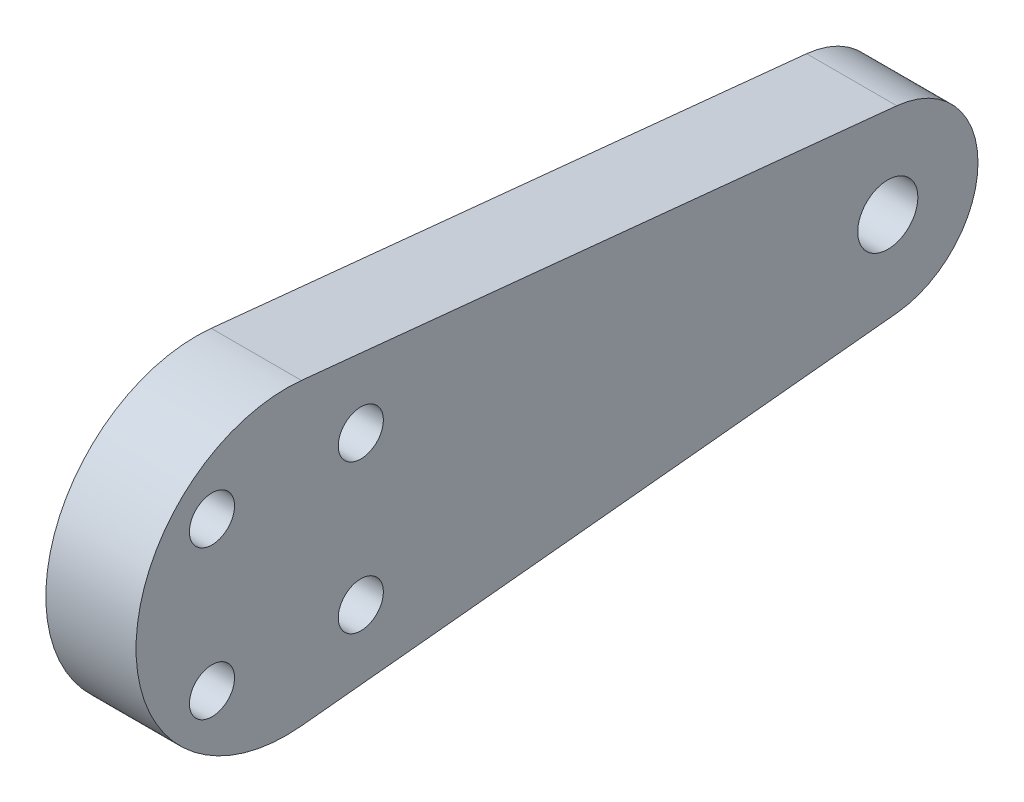
ISO-10303-21;
HEADER;
FILE_DESCRIPTION(('STEP AP214'),'2;1');
FILE_NAME('part.step','',(''),(''),'','','');
FILE_SCHEMA(('AUTOMOTIVE_DESIGN { 1 0 10303 214 1 1 1 1 }'));
ENDSEC;
DATA;
#1=APPLICATION_CONTEXT('core data for automotive mechanical design processes');
#2=APPLICATION_PROTOCOL_DEFINITION('international standard','automotive_design',2000,#1);
#3=PRODUCT_CONTEXT('',#1,'mechanical');
#4=PRODUCT('Part','Part','',(#3));
#5=PRODUCT_RELATED_PRODUCT_CATEGORY('part','',(#4));
#6=PRODUCT_DEFINITION_FORMATION('','',#4);
#7=PRODUCT_DEFINITION_CONTEXT('part definition',#1,'design');
#8=PRODUCT_DEFINITION('design','',#6,#7);
#9=PRODUCT_DEFINITION_SHAPE('','',#8);
#10=(LENGTH_UNIT() NAMED_UNIT(*) SI_UNIT(.MILLI.,.METRE.));
#11=(NAMED_UNIT(*) PLANE_ANGLE_UNIT() SI_UNIT($,.RADIAN.));
#12=(NAMED_UNIT(*) SI_UNIT($,.STERADIAN.) SOLID_ANGLE_UNIT());
#13=UNCERTAINTY_MEASURE_WITH_UNIT(LENGTH_MEASURE(1.E-05),#10,'distance_accuracy_value','');
#14=(GEOMETRIC_REPRESENTATION_CONTEXT(3) GLOBAL_UNCERTAINTY_ASSIGNED_CONTEXT((#13)) GLOBAL_UNIT_ASSIGNED_CONTEXT((#10,
#11,#12)) REPRESENTATION_CONTEXT('',''));
#15=CARTESIAN_POINT('',(0.,0.,0.));
#16=DIRECTION('',(0.,0.,1.));
#17=DIRECTION('',(1.,0.,0.));
#18=AXIS2_PLACEMENT_3D('',#15,#16,#17);
#19=CARTESIAN_POINT('',(3.,0.,0.));
#20=DIRECTION('',(-1.,0.,0.));
#21=DIRECTION('',(0.,0.,1.));
#22=AXIS2_PLACEMENT_3D('',#19,#20,#21);
#23=CYLINDRICAL_SURFACE('',#22,10.0000000000071);
#24=CARTESIAN_POINT('',(-3.,0.,0.));
#25=DIRECTION('',(1.,0.,0.));
#26=DIRECTION('',(0.,0.,-1.));
#27=AXIS2_PLACEMENT_3D('',#24,#25,#26);
#28=CIRCLE('',#27,10.0000000000071);
#29=CARTESIAN_POINT('',(-3.,9.94987437106971,-1.00000000000055));
#30=VERTEX_POINT('',#29);
#31=CARTESIAN_POINT('',(-3.,-9.94987437106975,-1.00000000000014));
#32=VERTEX_POINT('',#31);
#33=EDGE_CURVE('E107',#30,#32,#28,.T.);
#34=ORIENTED_EDGE('',*,*,#33,.T.);
#35=DIRECTION('',(-1.,0.,0.));
#36=VECTOR('',#35,1.);
#37=CARTESIAN_POINT('',(3.,-9.94987437106975,-1.00000000000014));
#38=LINE('',#37,#36);
#39=CARTESIAN_POINT('',(3.,-9.94987437106975,-1.00000000000014));
#40=VERTEX_POINT('',#39);
#41=EDGE_CURVE('E11',#40,#32,#38,.T.);
#42=ORIENTED_EDGE('',*,*,#41,.F.);
#43=CARTESIAN_POINT('',(3.,0.,0.));
#44=DIRECTION('',(1.,0.,0.));
#45=DIRECTION('',(0.,0.,-1.));
#46=AXIS2_PLACEMENT_3D('',#43,#44,#45);
#47=CIRCLE('',#46,10.0000000000071);
#48=CARTESIAN_POINT('',(3.,9.94987437106971,-1.00000000000055));
#49=VERTEX_POINT('',#48);
#50=EDGE_CURVE('E85',#49,#40,#47,.T.);
#51=ORIENTED_EDGE('',*,*,#50,.F.);
#52=DIRECTION('',(-1.,0.,0.));
#53=VECTOR('',#52,1.);
#54=CARTESIAN_POINT('',(3.,9.94987437106971,-1.00000000000055));
#55=LINE('',#54,#53);
#56=EDGE_CURVE('E106',#49,#30,#55,.T.);
#57=ORIENTED_EDGE('',*,*,#56,.T.);
#58=EDGE_LOOP('',(#34,#42,#51,#57));
#59=FACE_BOUND('',#58,.T.);
#60=ADVANCED_FACE('F43',(#59),#23,.T.);
#61=CARTESIAN_POINT('',(3.,-9.94987437106623,-0.999999999999792));
#62=DIRECTION('',(0.,-0.994987437106622,-0.0999999999999791));
#63=DIRECTION('',(0.,0.0999999999999791,-0.994987437106622));
#64=AXIS2_PLACEMENT_3D('',#61,#62,#63);
#65=PLANE('',#64);
#66=DIRECTION('',(0.,-0.0999999999999791,0.994987437106622));
#67=VECTOR('',#66,1.);
#68=CARTESIAN_POINT('',(-3.,-9.94987437106623,-0.999999999999792));
#69=LINE('',#68,#67);
#70=CARTESIAN_POINT('',(-3.,-5.96992462264674,-40.6000000000006));
#71=VERTEX_POINT('',#70);
#72=EDGE_CURVE('E95',#71,#32,#69,.T.);
#73=ORIENTED_EDGE('',*,*,#72,.F.);
#74=DIRECTION('',(-1.,0.,0.));
#75=VECTOR('',#74,1.);
#76=CARTESIAN_POINT('',(3.,-5.96992462264674,-40.6000000000006));
#77=LINE('',#76,#75);
#78=CARTESIAN_POINT('',(3.,-5.96992462264674,-40.6000000000006));
#79=VERTEX_POINT('',#78);
#80=EDGE_CURVE('E51',#79,#71,#77,.T.);
#81=ORIENTED_EDGE('',*,*,#80,.F.);
#82=DIRECTION('',(0.,-0.0999999999999791,0.994987437106622));
#83=VECTOR('',#82,1.);
#84=CARTESIAN_POINT('',(3.,-9.94987437106623,-0.999999999999792));
#85=LINE('',#84,#83);
#86=EDGE_CURVE('E93',#79,#40,#85,.T.);
#87=ORIENTED_EDGE('',*,*,#86,.T.);
#88=ORIENTED_EDGE('',*,*,#41,.T.);
#89=EDGE_LOOP('',(#73,#81,#87,#88));
#90=FACE_BOUND('',#89,.T.);
#91=ADVANCED_FACE('F92',(#90),#65,.T.);
#92=CARTESIAN_POINT('',(3.,-8.30932591879765E-13,-40.0000000000001));
#93=DIRECTION('',(-1.,0.,0.));
#94=DIRECTION('',(0.,0.,1.));
#95=AXIS2_PLACEMENT_3D('',#92,#93,#94);
#96=CYLINDRICAL_SURFACE('',#95,6.00000000001241);
#97=CARTESIAN_POINT('',(-3.,-8.30932591879765E-13,-40.0000000000001));
#98=DIRECTION('',(1.,0.,0.));
#99=DIRECTION('',(0.,0.,-1.));
#100=AXIS2_PLACEMENT_3D('',#97,#98,#99);
#101=CIRCLE('',#100,6.00000000001241);
#102=CARTESIAN_POINT('',(-3.,5.96992462264505,-40.6000000000009));
#103=VERTEX_POINT('',#102);
#104=EDGE_CURVE('E74',#71,#103,#101,.T.);
#105=ORIENTED_EDGE('',*,*,#104,.T.);
#106=DIRECTION('',(-1.,0.,0.));
#107=VECTOR('',#106,1.);
#108=CARTESIAN_POINT('',(3.,5.96992462264505,-40.6000000000009));
#109=LINE('',#108,#107);
#110=CARTESIAN_POINT('',(3.,5.96992462264505,-40.6000000000009));
#111=VERTEX_POINT('',#110);
#112=EDGE_CURVE('E96',#111,#103,#109,.T.);
#113=ORIENTED_EDGE('',*,*,#112,.F.);
#114=CARTESIAN_POINT('',(3.,-8.30932591879765E-13,-40.0000000000001));
#115=DIRECTION('',(1.,0.,0.));
#116=DIRECTION('',(0.,0.,-1.));
#117=AXIS2_PLACEMENT_3D('',#114,#115,#116);
#118=CIRCLE('',#117,6.00000000001241);
#119=EDGE_CURVE('E97',#79,#111,#118,.T.);
#120=ORIENTED_EDGE('',*,*,#119,.F.);
#121=ORIENTED_EDGE('',*,*,#80,.T.);
#122=EDGE_LOOP('',(#105,#113,#120,#121));
#123=FACE_BOUND('',#122,.T.);
#124=ADVANCED_FACE('F98',(#123),#96,.T.);
#125=CARTESIAN_POINT('',(3.,9.94987437106618,-1.0000000000002));
#126=DIRECTION('',(0.,-0.994987437106618,0.10000000000002));
#127=DIRECTION('',(0.,-0.10000000000002,-0.994987437106618));
#128=AXIS2_PLACEMENT_3D('',#125,#126,#127);
#129=PLANE('',#128);
#130=DIRECTION('',(0.,0.10000000000002,0.994987437106618));
#131=VECTOR('',#130,1.);
#132=CARTESIAN_POINT('',(-3.,9.94987437106618,-1.0000000000002));
#133=LINE('',#132,#131);
#134=EDGE_CURVE('E80',#103,#30,#133,.T.);
#135=ORIENTED_EDGE('',*,*,#134,.T.);
#136=ORIENTED_EDGE('',*,*,#56,.F.);
#137=DIRECTION('',(0.,0.10000000000002,0.994987437106618));
#138=VECTOR('',#137,1.);
#139=CARTESIAN_POINT('',(3.,9.94987437106618,-1.0000000000002));
#140=LINE('',#139,#138);
#141=EDGE_CURVE('E59',#111,#49,#140,.T.);
#142=ORIENTED_EDGE('',*,*,#141,.F.);
#143=ORIENTED_EDGE('',*,*,#112,.T.);
#144=EDGE_LOOP('',(#135,#136,#142,#143));
#145=FACE_BOUND('',#144,.T.);
#146=ADVANCED_FACE('F115',(#145),#129,.F.);
#147=CARTESIAN_POINT('',(3.,0.,0.));
#148=DIRECTION('',(1.,0.,0.));
#149=DIRECTION('',(0.,0.,-1.));
#150=AXIS2_PLACEMENT_3D('',#147,#148,#149);
#151=PLANE('',#150);
#152=CARTESIAN_POINT('',(3.,-8.30932544992891E-13,-40.0000000000001));
#153=DIRECTION('',(1.,0.,0.));
#154=DIRECTION('',(0.,0.,-1.));
#155=AXIS2_PLACEMENT_3D('',#152,#153,#154);
#156=CIRCLE('',#155,2.);
#157=CARTESIAN_POINT('',(3.,-8.30932544992891E-13,-42.0000000000001));
#158=VERTEX_POINT('',#157);
#159=EDGE_CURVE('E164',#158,#158,#156,.T.);
#160=ORIENTED_EDGE('',*,*,#159,.F.);
#161=EDGE_LOOP('',(#160));
#162=FACE_BOUND('',#161,.T.);
#163=CARTESIAN_POINT('',(3.,4.94974746830611,4.94974746830556));
#164=DIRECTION('',(1.,0.,0.));
#165=DIRECTION('',(0.,0.,-1.));
#166=AXIS2_PLACEMENT_3D('',#163,#164,#165);
#167=CIRCLE('',#166,1.50000000000047);
#168=CARTESIAN_POINT('',(3.,4.94974746830611,3.44974746830509));
#169=VERTEX_POINT('',#168);
#170=EDGE_CURVE('E180',#169,#169,#167,.T.);
#171=ORIENTED_EDGE('',*,*,#170,.F.);
#172=EDGE_LOOP('',(#171));
#173=FACE_BOUND('',#172,.T.);
#174=CARTESIAN_POINT('',(3.,-4.94974746830555,4.94974746830584));
#175=DIRECTION('',(1.,0.,0.));
#176=DIRECTION('',(0.,0.,-1.));
#177=AXIS2_PLACEMENT_3D('',#174,#175,#176);
#178=CIRCLE('',#177,1.50000000000037);
#179=CARTESIAN_POINT('',(3.,-4.94974746830555,3.44974746830546));
#180=VERTEX_POINT('',#179);
#181=EDGE_CURVE('E173',#180,#180,#178,.T.);
#182=ORIENTED_EDGE('',*,*,#181,.F.);
#183=EDGE_LOOP('',(#182));
#184=FACE_BOUND('',#183,.T.);
#185=CARTESIAN_POINT('',(3.,-4.94974746830584,-4.94974746830583));
#186=DIRECTION('',(1.,0.,0.));
#187=DIRECTION('',(0.,0.,-1.));
#188=AXIS2_PLACEMENT_3D('',#185,#186,#187);
#189=CIRCLE('',#188,1.50000000000006);
#190=CARTESIAN_POINT('',(3.,-4.94974746830584,-6.44974746830589));
#191=VERTEX_POINT('',#190);
#192=EDGE_CURVE('E172',#191,#191,#189,.T.);
#193=ORIENTED_EDGE('',*,*,#192,.F.);
#194=EDGE_LOOP('',(#193));
#195=FACE_BOUND('',#194,.T.);
#196=CARTESIAN_POINT('',(3.,4.94974746830583,-4.94974746830611));
#197=DIRECTION('',(1.,0.,0.));
#198=DIRECTION('',(0.,0.,-1.));
#199=AXIS2_PLACEMENT_3D('',#196,#197,#198);
#200=CIRCLE('',#199,1.50000000000023);
#201=CARTESIAN_POINT('',(3.,4.94974746830583,-6.44974746830634));
#202=VERTEX_POINT('',#201);
#203=EDGE_CURVE('E176',#202,#202,#200,.T.);
#204=ORIENTED_EDGE('',*,*,#203,.F.);
#205=EDGE_LOOP('',(#204));
#206=FACE_BOUND('',#205,.T.);
#207=ORIENTED_EDGE('',*,*,#50,.T.);
#208=ORIENTED_EDGE('',*,*,#86,.F.);
#209=ORIENTED_EDGE('',*,*,#119,.T.);
#210=ORIENTED_EDGE('',*,*,#141,.T.);
#211=EDGE_LOOP('',(#207,#208,#209,#210));
#212=FACE_BOUND('',#211,.T.);
#213=ADVANCED_FACE('F100',(#162,#173,#184,#195,#206,#212),#151,.T.);
#214=CARTESIAN_POINT('',(-3.,0.,0.));
#215=DIRECTION('',(1.,0.,0.));
#216=DIRECTION('',(0.,0.,-1.));
#217=AXIS2_PLACEMENT_3D('',#214,#215,#216);
#218=PLANE('',#217);
#219=CARTESIAN_POINT('',(-3.,-8.30932544992891E-13,-40.0000000000001));
#220=DIRECTION('',(1.,0.,0.));
#221=DIRECTION('',(0.,0.,-1.));
#222=AXIS2_PLACEMENT_3D('',#219,#220,#221);
#223=CIRCLE('',#222,2.);
#224=CARTESIAN_POINT('',(-3.,-8.30932544992891E-13,-42.0000000000001));
#225=VERTEX_POINT('',#224);
#226=EDGE_CURVE('E161',#225,#225,#223,.T.);
#227=ORIENTED_EDGE('',*,*,#226,.T.);
#228=EDGE_LOOP('',(#227));
#229=FACE_BOUND('',#228,.T.);
#230=CARTESIAN_POINT('',(-3.,4.94974746830611,4.94974746830556));
#231=DIRECTION('',(1.,0.,0.));
#232=DIRECTION('',(0.,0.,-1.));
#233=AXIS2_PLACEMENT_3D('',#230,#231,#232);
#234=CIRCLE('',#233,1.50000000000047);
#235=CARTESIAN_POINT('',(-3.,4.94974746830611,3.44974746830509));
#236=VERTEX_POINT('',#235);
#237=EDGE_CURVE('E166',#236,#236,#234,.T.);
#238=ORIENTED_EDGE('',*,*,#237,.T.);
#239=EDGE_LOOP('',(#238));
#240=FACE_BOUND('',#239,.T.);
#241=CARTESIAN_POINT('',(-3.,-4.94974746830555,4.94974746830584));
#242=DIRECTION('',(1.,0.,0.));
#243=DIRECTION('',(0.,0.,-1.));
#244=AXIS2_PLACEMENT_3D('',#241,#242,#243);
#245=CIRCLE('',#244,1.50000000000037);
#246=CARTESIAN_POINT('',(-3.,-4.94974746830555,3.44974746830546));
#247=VERTEX_POINT('',#246);
#248=EDGE_CURVE('E177',#247,#247,#245,.T.);
#249=ORIENTED_EDGE('',*,*,#248,.T.);
#250=EDGE_LOOP('',(#249));
#251=FACE_BOUND('',#250,.T.);
#252=CARTESIAN_POINT('',(-3.,-4.94974746830584,-4.94974746830583));
#253=DIRECTION('',(1.,0.,0.));
#254=DIRECTION('',(0.,0.,-1.));
#255=AXIS2_PLACEMENT_3D('',#252,#253,#254);
#256=CIRCLE('',#255,1.50000000000006);
#257=CARTESIAN_POINT('',(-3.,-4.94974746830584,-6.44974746830589));
#258=VERTEX_POINT('',#257);
#259=EDGE_CURVE('E169',#258,#258,#256,.T.);
#260=ORIENTED_EDGE('',*,*,#259,.T.);
#261=EDGE_LOOP('',(#260));
#262=FACE_BOUND('',#261,.T.);
#263=CARTESIAN_POINT('',(-3.,4.94974746830583,-4.94974746830611));
#264=DIRECTION('',(1.,0.,0.));
#265=DIRECTION('',(0.,0.,-1.));
#266=AXIS2_PLACEMENT_3D('',#263,#264,#265);
#267=CIRCLE('',#266,1.50000000000023);
#268=CARTESIAN_POINT('',(-3.,4.94974746830583,-6.44974746830634));
#269=VERTEX_POINT('',#268);
#270=EDGE_CURVE('E110',#269,#269,#267,.T.);
#271=ORIENTED_EDGE('',*,*,#270,.T.);
#272=EDGE_LOOP('',(#271));
#273=FACE_BOUND('',#272,.T.);
#274=ORIENTED_EDGE('',*,*,#33,.F.);
#275=ORIENTED_EDGE('',*,*,#134,.F.);
#276=ORIENTED_EDGE('',*,*,#104,.F.);
#277=ORIENTED_EDGE('',*,*,#72,.T.);
#278=EDGE_LOOP('',(#274,#275,#276,#277));
#279=FACE_BOUND('',#278,.T.);
#280=ADVANCED_FACE('F118',(#229,#240,#251,#262,#273,#279),#218,.F.);
#281=CARTESIAN_POINT('',(-3.,4.94974746830583,-4.94974746830611));
#282=DIRECTION('',(1.,0.,0.));
#283=DIRECTION('',(0.,0.,-1.));
#284=AXIS2_PLACEMENT_3D('',#281,#282,#283);
#285=CYLINDRICAL_SURFACE('',#284,1.50000000000023);
#286=ORIENTED_EDGE('',*,*,#270,.F.);
#287=EDGE_LOOP('',(#286));
#288=FACE_BOUND('',#287,.T.);
#289=ORIENTED_EDGE('',*,*,#203,.T.);
#290=EDGE_LOOP('',(#289));
#291=FACE_BOUND('',#290,.T.);
#292=ADVANCED_FACE('F133',(#288,#291),#285,.F.);
#293=CARTESIAN_POINT('',(-3.,-4.94974746830584,-4.94974746830583));
#294=DIRECTION('',(1.,0.,0.));
#295=DIRECTION('',(0.,0.,-1.));
#296=AXIS2_PLACEMENT_3D('',#293,#294,#295);
#297=CYLINDRICAL_SURFACE('',#296,1.50000000000006);
#298=ORIENTED_EDGE('',*,*,#259,.F.);
#299=EDGE_LOOP('',(#298));
#300=FACE_BOUND('',#299,.T.);
#301=ORIENTED_EDGE('',*,*,#192,.T.);
#302=EDGE_LOOP('',(#301));
#303=FACE_BOUND('',#302,.T.);
#304=ADVANCED_FACE('F140',(#300,#303),#297,.F.);
#305=CARTESIAN_POINT('',(-3.,-4.94974746830555,4.94974746830584));
#306=DIRECTION('',(1.,0.,0.));
#307=DIRECTION('',(0.,0.,-1.));
#308=AXIS2_PLACEMENT_3D('',#305,#306,#307);
#309=CYLINDRICAL_SURFACE('',#308,1.50000000000037);
#310=ORIENTED_EDGE('',*,*,#248,.F.);
#311=EDGE_LOOP('',(#310));
#312=FACE_BOUND('',#311,.T.);
#313=ORIENTED_EDGE('',*,*,#181,.T.);
#314=EDGE_LOOP('',(#313));
#315=FACE_BOUND('',#314,.T.);
#316=ADVANCED_FACE('F146',(#312,#315),#309,.F.);
#317=CARTESIAN_POINT('',(-3.,4.94974746830611,4.94974746830556));
#318=DIRECTION('',(1.,0.,0.));
#319=DIRECTION('',(0.,0.,-1.));
#320=AXIS2_PLACEMENT_3D('',#317,#318,#319);
#321=CYLINDRICAL_SURFACE('',#320,1.50000000000047);
#322=ORIENTED_EDGE('',*,*,#237,.F.);
#323=EDGE_LOOP('',(#322));
#324=FACE_BOUND('',#323,.T.);
#325=ORIENTED_EDGE('',*,*,#170,.T.);
#326=EDGE_LOOP('',(#325));
#327=FACE_BOUND('',#326,.T.);
#328=ADVANCED_FACE('F142',(#324,#327),#321,.F.);
#329=CARTESIAN_POINT('',(3.,-8.30932544992891E-13,-40.0000000000001));
#330=DIRECTION('',(1.,0.,0.));
#331=DIRECTION('',(0.,0.,-1.));
#332=AXIS2_PLACEMENT_3D('',#329,#330,#331);
#333=CYLINDRICAL_SURFACE('',#332,2.);
#334=ORIENTED_EDGE('',*,*,#226,.F.);
#335=EDGE_LOOP('',(#334));
#336=FACE_BOUND('',#335,.T.);
#337=ORIENTED_EDGE('',*,*,#159,.T.);
#338=EDGE_LOOP('',(#337));
#339=FACE_BOUND('',#338,.T.);
#340=ADVANCED_FACE('F145',(#336,#339),#333,.F.);
#341=CLOSED_SHELL('',(#60,#91,#124,#146,#213,#280,#292,#304,#316,#328,#340));
#342=MANIFOLD_SOLID_BREP('B2',#341);
#343=ADVANCED_BREP_SHAPE_REPRESENTATION('',(#18,#342),#14);
#344=SHAPE_DEFINITION_REPRESENTATION(#9,#343);
ENDSEC;
END-ISO-10303-21;
